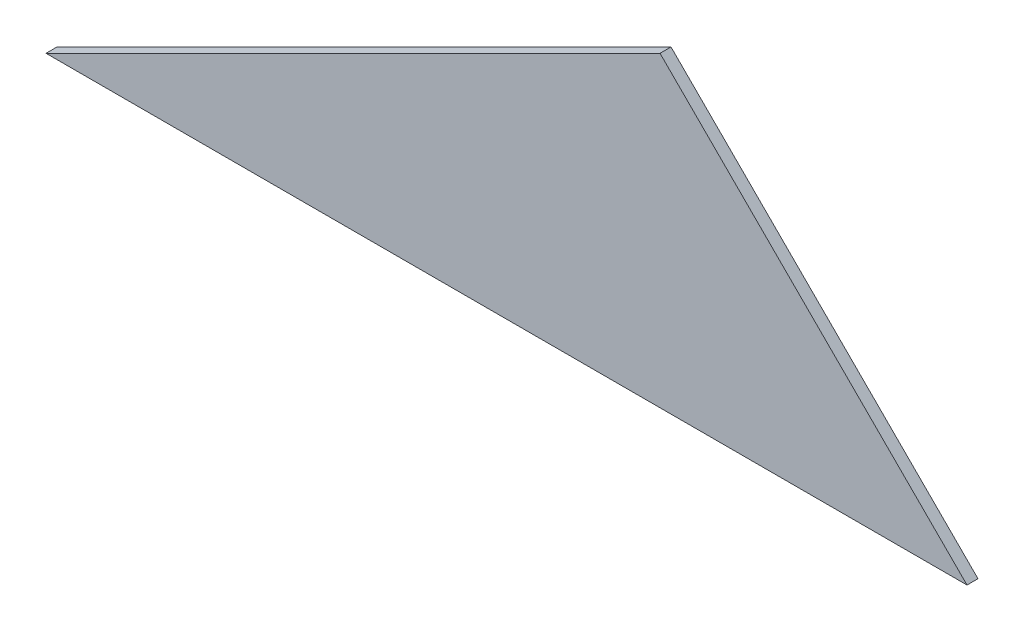
ISO-10303-21;
HEADER;
FILE_DESCRIPTION(('STEP AP214'),'2;1');
FILE_NAME('part.step','',(''),(''),'','','');
FILE_SCHEMA(('AUTOMOTIVE_DESIGN { 1 0 10303 214 1 1 1 1 }'));
ENDSEC;
DATA;
#1=APPLICATION_CONTEXT('core data for automotive mechanical design processes');
#2=APPLICATION_PROTOCOL_DEFINITION('international standard','automotive_design',2000,#1);
#3=PRODUCT_CONTEXT('',#1,'mechanical');
#4=PRODUCT('Part','Part','',(#3));
#5=PRODUCT_RELATED_PRODUCT_CATEGORY('part','',(#4));
#6=PRODUCT_DEFINITION_FORMATION('','',#4);
#7=PRODUCT_DEFINITION_CONTEXT('part definition',#1,'design');
#8=PRODUCT_DEFINITION('design','',#6,#7);
#9=PRODUCT_DEFINITION_SHAPE('','',#8);
#10=(LENGTH_UNIT() NAMED_UNIT(*) SI_UNIT(.MILLI.,.METRE.));
#11=(NAMED_UNIT(*) PLANE_ANGLE_UNIT() SI_UNIT($,.RADIAN.));
#12=(NAMED_UNIT(*) SI_UNIT($,.STERADIAN.) SOLID_ANGLE_UNIT());
#13=UNCERTAINTY_MEASURE_WITH_UNIT(LENGTH_MEASURE(1.E-05),#10,'distance_accuracy_value','');
#14=(GEOMETRIC_REPRESENTATION_CONTEXT(3) GLOBAL_UNCERTAINTY_ASSIGNED_CONTEXT((#13)) GLOBAL_UNIT_ASSIGNED_CONTEXT((#10,
#11,#12)) REPRESENTATION_CONTEXT('',''));
#15=CARTESIAN_POINT('',(0.,0.,0.));
#16=DIRECTION('',(0.,0.,1.));
#17=DIRECTION('',(1.,0.,0.));
#18=AXIS2_PLACEMENT_3D('',#15,#16,#17);
#19=CARTESIAN_POINT('',(140.,70.,2.5));
#20=DIRECTION('',(0.447213595499958,-0.894427190999916,0.));
#21=DIRECTION('',(0.894427190999916,0.447213595499958,0.));
#22=AXIS2_PLACEMENT_3D('',#19,#20,#21);
#23=PLANE('',#22);
#24=DIRECTION('',(-0.894427190999916,-0.447213595499958,0.));
#25=VECTOR('',#24,1.);
#26=CARTESIAN_POINT('',(140.,70.,0.));
#27=LINE('',#26,#25);
#28=CARTESIAN_POINT('',(140.,70.,0.));
#29=VERTEX_POINT('',#28);
#30=CARTESIAN_POINT('',(0.,0.,0.));
#31=VERTEX_POINT('',#30);
#32=EDGE_CURVE('E80',#29,#31,#27,.T.);
#33=ORIENTED_EDGE('',*,*,#32,.T.);
#34=DIRECTION('',(0.,0.,-1.));
#35=VECTOR('',#34,1.);
#36=CARTESIAN_POINT('',(0.,0.,2.5));
#37=LINE('',#36,#35);
#38=CARTESIAN_POINT('',(0.,0.,2.5));
#39=VERTEX_POINT('',#38);
#40=EDGE_CURVE('E11',#39,#31,#37,.T.);
#41=ORIENTED_EDGE('',*,*,#40,.F.);
#42=DIRECTION('',(-0.894427190999916,-0.447213595499958,0.));
#43=VECTOR('',#42,1.);
#44=CARTESIAN_POINT('',(140.,70.,2.5));
#45=LINE('',#44,#43);
#46=CARTESIAN_POINT('',(140.,70.,2.5));
#47=VERTEX_POINT('',#46);
#48=EDGE_CURVE('E73',#47,#39,#45,.T.);
#49=ORIENTED_EDGE('',*,*,#48,.F.);
#50=DIRECTION('',(0.,0.,-1.));
#51=VECTOR('',#50,1.);
#52=CARTESIAN_POINT('',(140.,70.,2.5));
#53=LINE('',#52,#51);
#54=EDGE_CURVE('E81',#47,#29,#53,.T.);
#55=ORIENTED_EDGE('',*,*,#54,.T.);
#56=EDGE_LOOP('',(#33,#41,#49,#55));
#57=FACE_BOUND('',#56,.T.);
#58=ADVANCED_FACE('F33',(#57),#23,.F.);
#59=CARTESIAN_POINT('',(0.,0.,2.5));
#60=DIRECTION('',(0.,1.,0.));
#61=DIRECTION('',(0.,0.,1.));
#62=AXIS2_PLACEMENT_3D('',#59,#60,#61);
#63=PLANE('',#62);
#64=DIRECTION('',(1.,0.,0.));
#65=VECTOR('',#64,1.);
#66=CARTESIAN_POINT('',(0.,0.,0.));
#67=LINE('',#66,#65);
#68=CARTESIAN_POINT('',(210.,0.,0.));
#69=VERTEX_POINT('',#68);
#70=EDGE_CURVE('E61',#31,#69,#67,.T.);
#71=ORIENTED_EDGE('',*,*,#70,.T.);
#72=DIRECTION('',(0.,0.,-1.));
#73=VECTOR('',#72,1.);
#74=CARTESIAN_POINT('',(210.,0.,2.5));
#75=LINE('',#74,#73);
#76=CARTESIAN_POINT('',(210.,0.,2.5));
#77=VERTEX_POINT('',#76);
#78=EDGE_CURVE('E41',#77,#69,#75,.T.);
#79=ORIENTED_EDGE('',*,*,#78,.F.);
#80=DIRECTION('',(1.,0.,0.));
#81=VECTOR('',#80,1.);
#82=CARTESIAN_POINT('',(0.,0.,2.5));
#83=LINE('',#82,#81);
#84=EDGE_CURVE('E69',#39,#77,#83,.T.);
#85=ORIENTED_EDGE('',*,*,#84,.F.);
#86=ORIENTED_EDGE('',*,*,#40,.T.);
#87=EDGE_LOOP('',(#71,#79,#85,#86));
#88=FACE_BOUND('',#87,.T.);
#89=ADVANCED_FACE('F70',(#88),#63,.F.);
#90=CARTESIAN_POINT('',(210.,0.,2.5));
#91=DIRECTION('',(-0.707106781186548,-0.707106781186548,0.));
#92=DIRECTION('',(0.707106781186548,-0.707106781186548,0.));
#93=AXIS2_PLACEMENT_3D('',#90,#91,#92);
#94=PLANE('',#93);
#95=DIRECTION('',(-0.707106781186548,0.707106781186548,0.));
#96=VECTOR('',#95,1.);
#97=CARTESIAN_POINT('',(210.,0.,0.));
#98=LINE('',#97,#96);
#99=EDGE_CURVE('E66',#69,#29,#98,.T.);
#100=ORIENTED_EDGE('',*,*,#99,.T.);
#101=ORIENTED_EDGE('',*,*,#54,.F.);
#102=DIRECTION('',(-0.707106781186548,0.707106781186548,0.));
#103=VECTOR('',#102,1.);
#104=CARTESIAN_POINT('',(210.,0.,2.5));
#105=LINE('',#104,#103);
#106=EDGE_CURVE('E49',#77,#47,#105,.T.);
#107=ORIENTED_EDGE('',*,*,#106,.F.);
#108=ORIENTED_EDGE('',*,*,#78,.T.);
#109=EDGE_LOOP('',(#100,#101,#107,#108));
#110=FACE_BOUND('',#109,.T.);
#111=ADVANCED_FACE('F88',(#110),#94,.F.);
#112=CARTESIAN_POINT('',(0.,0.,2.5));
#113=DIRECTION('',(0.,0.,-1.));
#114=DIRECTION('',(-1.,0.,0.));
#115=AXIS2_PLACEMENT_3D('',#112,#113,#114);
#116=PLANE('',#115);
#117=ORIENTED_EDGE('',*,*,#48,.T.);
#118=ORIENTED_EDGE('',*,*,#84,.T.);
#119=ORIENTED_EDGE('',*,*,#106,.T.);
#120=EDGE_LOOP('',(#117,#118,#119));
#121=FACE_BOUND('',#120,.T.);
#122=ADVANCED_FACE('F76',(#121),#116,.F.);
#123=CARTESIAN_POINT('',(0.,0.,0.));
#124=DIRECTION('',(0.,0.,-1.));
#125=DIRECTION('',(-1.,0.,0.));
#126=AXIS2_PLACEMENT_3D('',#123,#124,#125);
#127=PLANE('',#126);
#128=ORIENTED_EDGE('',*,*,#32,.F.);
#129=ORIENTED_EDGE('',*,*,#99,.F.);
#130=ORIENTED_EDGE('',*,*,#70,.F.);
#131=EDGE_LOOP('',(#128,#129,#130));
#132=FACE_BOUND('',#131,.T.);
#133=ADVANCED_FACE('F89',(#132),#127,.T.);
#134=CLOSED_SHELL('',(#58,#89,#111,#122,#133));
#135=MANIFOLD_SOLID_BREP('B2',#134);
#136=ADVANCED_BREP_SHAPE_REPRESENTATION('',(#18,#135),#14);
#137=SHAPE_DEFINITION_REPRESENTATION(#9,#136);
ENDSEC;
END-ISO-10303-21;
